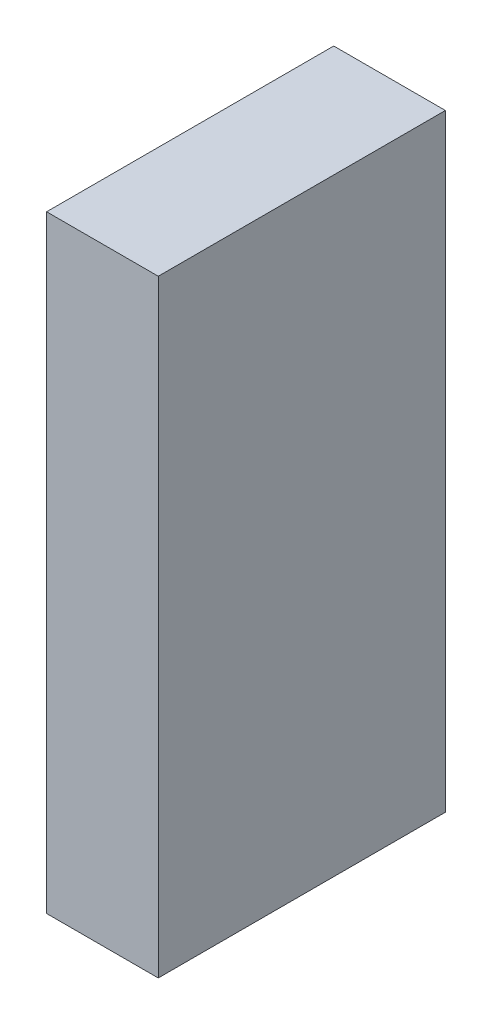
ISO-10303-21;
HEADER;
FILE_DESCRIPTION(('STEP AP214'),'2;1');
FILE_NAME('part.step','',(''),(''),'','','');
FILE_SCHEMA(('AUTOMOTIVE_DESIGN { 1 0 10303 214 1 1 1 1 }'));
ENDSEC;
DATA;
#1=APPLICATION_CONTEXT('core data for automotive mechanical design processes');
#2=APPLICATION_PROTOCOL_DEFINITION('international standard','automotive_design',2000,#1);
#3=PRODUCT_CONTEXT('',#1,'mechanical');
#4=PRODUCT('Part','Part','',(#3));
#5=PRODUCT_RELATED_PRODUCT_CATEGORY('part','',(#4));
#6=PRODUCT_DEFINITION_FORMATION('','',#4);
#7=PRODUCT_DEFINITION_CONTEXT('part definition',#1,'design');
#8=PRODUCT_DEFINITION('design','',#6,#7);
#9=PRODUCT_DEFINITION_SHAPE('','',#8);
#10=(LENGTH_UNIT() NAMED_UNIT(*) SI_UNIT(.MILLI.,.METRE.));
#11=(NAMED_UNIT(*) PLANE_ANGLE_UNIT() SI_UNIT($,.RADIAN.));
#12=(NAMED_UNIT(*) SI_UNIT($,.STERADIAN.) SOLID_ANGLE_UNIT());
#13=UNCERTAINTY_MEASURE_WITH_UNIT(LENGTH_MEASURE(1.E-05),#10,'distance_accuracy_value','');
#14=(GEOMETRIC_REPRESENTATION_CONTEXT(3) GLOBAL_UNCERTAINTY_ASSIGNED_CONTEXT((#13)) GLOBAL_UNIT_ASSIGNED_CONTEXT((#10,
#11,#12)) REPRESENTATION_CONTEXT('',''));
#15=CARTESIAN_POINT('',(0.,0.,0.));
#16=DIRECTION('',(0.,0.,1.));
#17=DIRECTION('',(1.,0.,0.));
#18=AXIS2_PLACEMENT_3D('',#15,#16,#17);
#19=CARTESIAN_POINT('',(7.,0.,0.));
#20=DIRECTION('',(0.,0.,-1.));
#21=DIRECTION('',(-1.,0.,0.));
#22=AXIS2_PLACEMENT_3D('',#19,#20,#21);
#23=PLANE('',#22);
#24=DIRECTION('',(0.,-1.,0.));
#25=VECTOR('',#24,1.);
#26=CARTESIAN_POINT('',(0.,0.,0.));
#27=LINE('',#26,#25);
#28=CARTESIAN_POINT('',(0.,38.1,0.));
#29=VERTEX_POINT('',#28);
#30=CARTESIAN_POINT('',(0.,0.,0.));
#31=VERTEX_POINT('',#30);
#32=EDGE_CURVE('E96',#29,#31,#27,.T.);
#33=ORIENTED_EDGE('',*,*,#32,.T.);
#34=DIRECTION('',(-1.,0.,0.));
#35=VECTOR('',#34,1.);
#36=CARTESIAN_POINT('',(7.,0.,0.));
#37=LINE('',#36,#35);
#38=CARTESIAN_POINT('',(7.,0.,0.));
#39=VERTEX_POINT('',#38);
#40=EDGE_CURVE('E11',#39,#31,#37,.T.);
#41=ORIENTED_EDGE('',*,*,#40,.F.);
#42=DIRECTION('',(0.,-1.,0.));
#43=VECTOR('',#42,1.);
#44=CARTESIAN_POINT('',(7.,0.,0.));
#45=LINE('',#44,#43);
#46=CARTESIAN_POINT('',(7.,38.1,0.));
#47=VERTEX_POINT('',#46);
#48=EDGE_CURVE('E84',#47,#39,#45,.T.);
#49=ORIENTED_EDGE('',*,*,#48,.F.);
#50=DIRECTION('',(-1.,0.,0.));
#51=VECTOR('',#50,1.);
#52=CARTESIAN_POINT('',(7.,38.1,0.));
#53=LINE('',#52,#51);
#54=EDGE_CURVE('E92',#47,#29,#53,.T.);
#55=ORIENTED_EDGE('',*,*,#54,.T.);
#56=EDGE_LOOP('',(#33,#41,#49,#55));
#57=FACE_BOUND('',#56,.T.);
#58=ADVANCED_FACE('F33',(#57),#23,.F.);
#59=CARTESIAN_POINT('',(7.,0.,0.));
#60=DIRECTION('',(0.,1.,0.));
#61=DIRECTION('',(0.,0.,1.));
#62=AXIS2_PLACEMENT_3D('',#59,#60,#61);
#63=PLANE('',#62);
#64=DIRECTION('',(0.,0.,-1.));
#65=VECTOR('',#64,1.);
#66=CARTESIAN_POINT('',(0.,0.,0.));
#67=LINE('',#66,#65);
#68=CARTESIAN_POINT('',(0.,0.,-18.));
#69=VERTEX_POINT('',#68);
#70=EDGE_CURVE('E88',#31,#69,#67,.T.);
#71=ORIENTED_EDGE('',*,*,#70,.T.);
#72=DIRECTION('',(-1.,0.,0.));
#73=VECTOR('',#72,1.);
#74=CARTESIAN_POINT('',(7.,0.,-18.));
#75=LINE('',#74,#73);
#76=CARTESIAN_POINT('',(7.,0.,-18.));
#77=VERTEX_POINT('',#76);
#78=EDGE_CURVE('E41',#77,#69,#75,.T.);
#79=ORIENTED_EDGE('',*,*,#78,.F.);
#80=DIRECTION('',(0.,0.,-1.));
#81=VECTOR('',#80,1.);
#82=CARTESIAN_POINT('',(7.,0.,0.));
#83=LINE('',#82,#81);
#84=EDGE_CURVE('E79',#39,#77,#83,.T.);
#85=ORIENTED_EDGE('',*,*,#84,.F.);
#86=ORIENTED_EDGE('',*,*,#40,.T.);
#87=EDGE_LOOP('',(#71,#79,#85,#86));
#88=FACE_BOUND('',#87,.T.);
#89=ADVANCED_FACE('F87',(#88),#63,.F.);
#90=CARTESIAN_POINT('',(7.,0.,-18.));
#91=DIRECTION('',(0.,0.,1.));
#92=DIRECTION('',(1.,0.,0.));
#93=AXIS2_PLACEMENT_3D('',#90,#91,#92);
#94=PLANE('',#93);
#95=DIRECTION('',(0.,1.,0.));
#96=VECTOR('',#95,1.);
#97=CARTESIAN_POINT('',(0.,0.,-18.));
#98=LINE('',#97,#96);
#99=CARTESIAN_POINT('',(0.,38.1,-18.));
#100=VERTEX_POINT('',#99);
#101=EDGE_CURVE('E66',#69,#100,#98,.T.);
#102=ORIENTED_EDGE('',*,*,#101,.T.);
#103=DIRECTION('',(-1.,0.,0.));
#104=VECTOR('',#103,1.);
#105=CARTESIAN_POINT('',(7.,38.1,-18.));
#106=LINE('',#105,#104);
#107=CARTESIAN_POINT('',(7.,38.1,-18.));
#108=VERTEX_POINT('',#107);
#109=EDGE_CURVE('E89',#108,#100,#106,.T.);
#110=ORIENTED_EDGE('',*,*,#109,.F.);
#111=DIRECTION('',(0.,1.,0.));
#112=VECTOR('',#111,1.);
#113=CARTESIAN_POINT('',(7.,0.,-18.));
#114=LINE('',#113,#112);
#115=EDGE_CURVE('E82',#77,#108,#114,.T.);
#116=ORIENTED_EDGE('',*,*,#115,.F.);
#117=ORIENTED_EDGE('',*,*,#78,.T.);
#118=EDGE_LOOP('',(#102,#110,#116,#117));
#119=FACE_BOUND('',#118,.T.);
#120=ADVANCED_FACE('F90',(#119),#94,.F.);
#121=CARTESIAN_POINT('',(7.,38.1,0.));
#122=DIRECTION('',(0.,-1.,0.));
#123=DIRECTION('',(0.,0.,-1.));
#124=AXIS2_PLACEMENT_3D('',#121,#122,#123);
#125=PLANE('',#124);
#126=DIRECTION('',(0.,0.,1.));
#127=VECTOR('',#126,1.);
#128=CARTESIAN_POINT('',(0.,38.1,0.));
#129=LINE('',#128,#127);
#130=EDGE_CURVE('E72',#100,#29,#129,.T.);
#131=ORIENTED_EDGE('',*,*,#130,.T.);
#132=ORIENTED_EDGE('',*,*,#54,.F.);
#133=DIRECTION('',(0.,0.,1.));
#134=VECTOR('',#133,1.);
#135=CARTESIAN_POINT('',(7.,38.1,0.));
#136=LINE('',#135,#134);
#137=EDGE_CURVE('E49',#108,#47,#136,.T.);
#138=ORIENTED_EDGE('',*,*,#137,.F.);
#139=ORIENTED_EDGE('',*,*,#109,.T.);
#140=EDGE_LOOP('',(#131,#132,#138,#139));
#141=FACE_BOUND('',#140,.T.);
#142=ADVANCED_FACE('F103',(#141),#125,.F.);
#143=CARTESIAN_POINT('',(7.,0.,0.));
#144=DIRECTION('',(-1.,0.,0.));
#145=DIRECTION('',(0.,0.,1.));
#146=AXIS2_PLACEMENT_3D('',#143,#144,#145);
#147=PLANE('',#146);
#148=ORIENTED_EDGE('',*,*,#48,.T.);
#149=ORIENTED_EDGE('',*,*,#84,.T.);
#150=ORIENTED_EDGE('',*,*,#115,.T.);
#151=ORIENTED_EDGE('',*,*,#137,.T.);
#152=EDGE_LOOP('',(#148,#149,#150,#151));
#153=FACE_BOUND('',#152,.T.);
#154=ADVANCED_FACE('F80',(#153),#147,.F.);
#155=CARTESIAN_POINT('',(0.,0.,0.));
#156=DIRECTION('',(-1.,0.,0.));
#157=DIRECTION('',(0.,0.,1.));
#158=AXIS2_PLACEMENT_3D('',#155,#156,#157);
#159=PLANE('',#158);
#160=ORIENTED_EDGE('',*,*,#32,.F.);
#161=ORIENTED_EDGE('',*,*,#130,.F.);
#162=ORIENTED_EDGE('',*,*,#101,.F.);
#163=ORIENTED_EDGE('',*,*,#70,.F.);
#164=EDGE_LOOP('',(#160,#161,#162,#163));
#165=FACE_BOUND('',#164,.T.);
#166=ADVANCED_FACE('F106',(#165),#159,.T.);
#167=CLOSED_SHELL('',(#58,#89,#120,#142,#154,#166));
#168=MANIFOLD_SOLID_BREP('B2',#167);
#169=ADVANCED_BREP_SHAPE_REPRESENTATION('',(#18,#168),#14);
#170=SHAPE_DEFINITION_REPRESENTATION(#9,#169);
ENDSEC;
END-ISO-10303-21;
